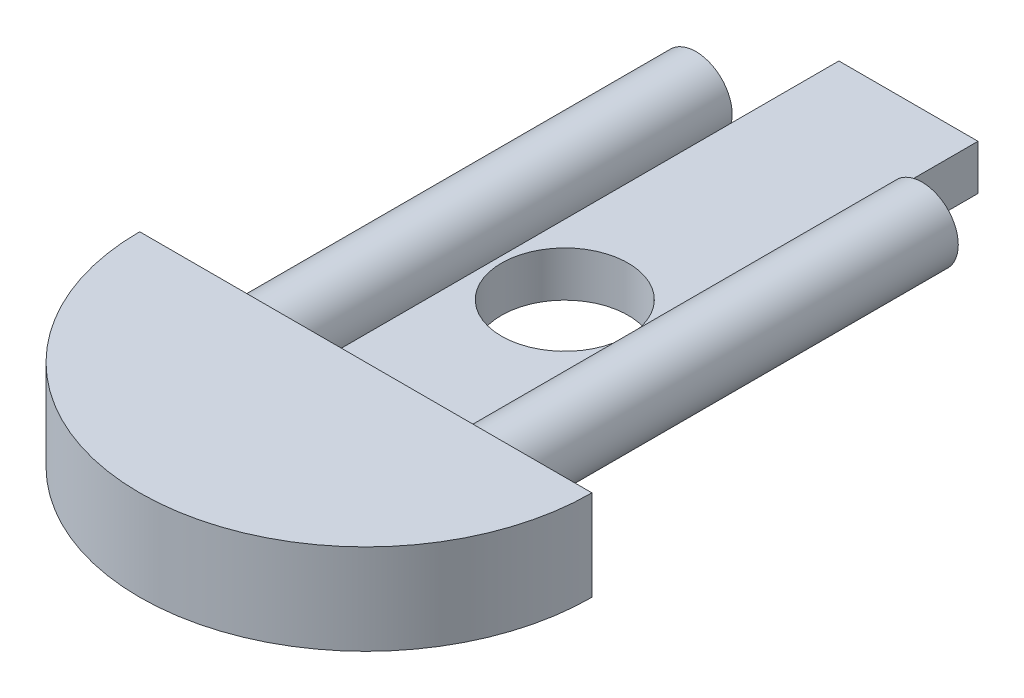
ISO-10303-21;
HEADER;
FILE_DESCRIPTION(('STEP AP214'),'2;1');
FILE_NAME('part.step','',(''),(''),'','','');
FILE_SCHEMA(('AUTOMOTIVE_DESIGN { 1 0 10303 214 1 1 1 1 }'));
ENDSEC;
DATA;
#1=APPLICATION_CONTEXT('core data for automotive mechanical design processes');
#2=APPLICATION_PROTOCOL_DEFINITION('international standard','automotive_design',2000,#1);
#3=PRODUCT_CONTEXT('',#1,'mechanical');
#4=PRODUCT('Part','Part','',(#3));
#5=PRODUCT_RELATED_PRODUCT_CATEGORY('part','',(#4));
#6=PRODUCT_DEFINITION_FORMATION('','',#4);
#7=PRODUCT_DEFINITION_CONTEXT('part definition',#1,'design');
#8=PRODUCT_DEFINITION('design','',#6,#7);
#9=PRODUCT_DEFINITION_SHAPE('','',#8);
#10=(LENGTH_UNIT() NAMED_UNIT(*) SI_UNIT(.MILLI.,.METRE.));
#11=(NAMED_UNIT(*) PLANE_ANGLE_UNIT() SI_UNIT($,.RADIAN.));
#12=(NAMED_UNIT(*) SI_UNIT($,.STERADIAN.) SOLID_ANGLE_UNIT());
#13=UNCERTAINTY_MEASURE_WITH_UNIT(LENGTH_MEASURE(1.E-05),#10,'distance_accuracy_value','');
#14=(GEOMETRIC_REPRESENTATION_CONTEXT(3) GLOBAL_UNCERTAINTY_ASSIGNED_CONTEXT((#13)) GLOBAL_UNIT_ASSIGNED_CONTEXT((#10,
#11,#12)) REPRESENTATION_CONTEXT('',''));
#15=CARTESIAN_POINT('',(0.,0.,0.));
#16=DIRECTION('',(0.,0.,1.));
#17=DIRECTION('',(1.,0.,0.));
#18=AXIS2_PLACEMENT_3D('',#15,#16,#17);
#19=CARTESIAN_POINT('',(63.5,0.,-2.21709065016539E-13));
#20=DIRECTION('',(0.,0.,1.));
#21=DIRECTION('',(1.,0.,0.));
#22=AXIS2_PLACEMENT_3D('',#19,#20,#21);
#23=PLANE('',#22);
#24=CARTESIAN_POINT('',(47.625,6.35,-1.11022302462516E-13));
#25=DIRECTION('',(0.,0.,1.));
#26=DIRECTION('',(1.,0.,0.));
#27=AXIS2_PLACEMENT_3D('',#24,#25,#26);
#28=CIRCLE('',#27,5.08);
#29=CARTESIAN_POINT('',(52.705,6.35,-1.46495752865162E-13));
#30=VERTEX_POINT('',#29);
#31=EDGE_CURVE('E48',#30,#30,#28,.F.);
#32=ORIENTED_EDGE('',*,*,#31,.F.);
#33=EDGE_LOOP('',(#32));
#34=FACE_BOUND('',#33,.T.);
#35=CARTESIAN_POINT('',(15.875,6.35,1.11022302462516E-13));
#36=DIRECTION('',(0.,0.,1.));
#37=DIRECTION('',(1.,0.,0.));
#38=AXIS2_PLACEMENT_3D('',#35,#36,#37);
#39=CIRCLE('',#38,5.08);
#40=CARTESIAN_POINT('',(20.955,6.35,0.));
#41=VERTEX_POINT('',#40);
#42=EDGE_CURVE('E11',#41,#41,#39,.F.);
#43=ORIENTED_EDGE('',*,*,#42,.F.);
#44=EDGE_LOOP('',(#43));
#45=FACE_BOUND('',#44,.T.);
#46=DIRECTION('',(0.,-1.,0.));
#47=VECTOR('',#46,1.);
#48=CARTESIAN_POINT('',(41.5036,0.,-2.8981808978962E-13));
#49=LINE('',#48,#47);
#50=CARTESIAN_POINT('',(41.5036,6.35,0.));
#51=VERTEX_POINT('',#50);
#52=CARTESIAN_POINT('',(41.5036,0.,0.));
#53=VERTEX_POINT('',#52);
#54=EDGE_CURVE('E55',#51,#53,#49,.T.);
#55=ORIENTED_EDGE('',*,*,#54,.F.);
#56=DIRECTION('',(1.,0.,0.));
#57=VECTOR('',#56,1.);
#58=CARTESIAN_POINT('',(41.5036,6.35,-2.8981808978962E-13));
#59=LINE('',#58,#57);
#60=CARTESIAN_POINT('',(21.971,6.35,-1.53422672991445E-13));
#61=VERTEX_POINT('',#60);
#62=EDGE_CURVE('E115',#61,#51,#59,.T.);
#63=ORIENTED_EDGE('',*,*,#62,.F.);
#64=DIRECTION('',(0.,1.,0.));
#65=VECTOR('',#64,1.);
#66=CARTESIAN_POINT('',(21.971,0.,-1.53422672991445E-13));
#67=LINE('',#66,#65);
#68=CARTESIAN_POINT('',(21.971,0.,0.));
#69=VERTEX_POINT('',#68);
#70=EDGE_CURVE('E61',#69,#61,#67,.T.);
#71=ORIENTED_EDGE('',*,*,#70,.F.);
#72=DIRECTION('',(-1.,0.,0.));
#73=VECTOR('',#72,1.);
#74=CARTESIAN_POINT('',(63.5,0.,-2.21709065016539E-13));
#75=LINE('',#74,#73);
#76=CARTESIAN_POINT('',(0.,0.,0.));
#77=VERTEX_POINT('',#76);
#78=EDGE_CURVE('E139',#69,#77,#75,.T.);
#79=ORIENTED_EDGE('',*,*,#78,.T.);
#80=DIRECTION('',(0.,-1.,0.));
#81=VECTOR('',#80,1.);
#82=CARTESIAN_POINT('',(0.,0.,0.));
#83=LINE('',#82,#81);
#84=CARTESIAN_POINT('',(0.,12.7,0.));
#85=VERTEX_POINT('',#84);
#86=EDGE_CURVE('E131',#85,#77,#83,.T.);
#87=ORIENTED_EDGE('',*,*,#86,.F.);
#88=DIRECTION('',(1.,0.,0.));
#89=VECTOR('',#88,1.);
#90=CARTESIAN_POINT('',(63.5,12.7,-2.21709065016539E-13));
#91=LINE('',#90,#89);
#92=CARTESIAN_POINT('',(63.5,12.7,-2.21709065016539E-13));
#93=VERTEX_POINT('',#92);
#94=EDGE_CURVE('E143',#85,#93,#91,.T.);
#95=ORIENTED_EDGE('',*,*,#94,.T.);
#96=DIRECTION('',(0.,-1.,0.));
#97=VECTOR('',#96,1.);
#98=CARTESIAN_POINT('',(63.5,0.,-2.21709065016539E-13));
#99=LINE('',#98,#97);
#100=CARTESIAN_POINT('',(63.5,0.,-2.21709065016539E-13));
#101=VERTEX_POINT('',#100);
#102=EDGE_CURVE('E135',#93,#101,#99,.T.);
#103=ORIENTED_EDGE('',*,*,#102,.T.);
#104=EDGE_CURVE('E140',#101,#53,#75,.T.);
#105=ORIENTED_EDGE('',*,*,#104,.T.);
#106=EDGE_LOOP('',(#55,#63,#71,#79,#87,#95,#103,#105));
#107=FACE_BOUND('',#106,.T.);
#108=ADVANCED_FACE('F39',(#34,#45,#107),#23,.F.);
#109=CARTESIAN_POINT('',(31.75,0.,0.));
#110=DIRECTION('',(0.,-1.,0.));
#111=DIRECTION('',(0.,0.,-1.));
#112=AXIS2_PLACEMENT_3D('',#109,#110,#111);
#113=CYLINDRICAL_SURFACE('',#112,31.75);
#114=CARTESIAN_POINT('',(31.75,12.7,0.));
#115=DIRECTION('',(0.,-1.,0.));
#116=DIRECTION('',(0.,0.,-1.));
#117=AXIS2_PLACEMENT_3D('',#114,#115,#116);
#118=CIRCLE('',#117,31.75);
#119=EDGE_CURVE('E151',#93,#85,#118,.T.);
#120=ORIENTED_EDGE('',*,*,#119,.T.);
#121=ORIENTED_EDGE('',*,*,#86,.T.);
#122=CARTESIAN_POINT('',(31.75,0.,0.));
#123=DIRECTION('',(0.,-1.,0.));
#124=DIRECTION('',(0.,0.,-1.));
#125=AXIS2_PLACEMENT_3D('',#122,#123,#124);
#126=CIRCLE('',#125,31.75);
#127=EDGE_CURVE('E147',#101,#77,#126,.T.);
#128=ORIENTED_EDGE('',*,*,#127,.F.);
#129=ORIENTED_EDGE('',*,*,#102,.F.);
#130=EDGE_LOOP('',(#120,#121,#128,#129));
#131=FACE_BOUND('',#130,.T.);
#132=ADVANCED_FACE('F162',(#131),#113,.T.);
#133=CARTESIAN_POINT('',(63.5,12.7,-2.21709065016539E-13));
#134=DIRECTION('',(0.,-1.,0.));
#135=DIRECTION('',(0.,0.,-1.));
#136=AXIS2_PLACEMENT_3D('',#133,#134,#135);
#137=PLANE('',#136);
#138=ORIENTED_EDGE('',*,*,#94,.F.);
#139=ORIENTED_EDGE('',*,*,#119,.F.);
#140=EDGE_LOOP('',(#138,#139));
#141=FACE_BOUND('',#140,.T.);
#142=ADVANCED_FACE('F41',(#141),#137,.F.);
#143=CARTESIAN_POINT('',(63.5,0.,-2.21709065016539E-13));
#144=DIRECTION('',(0.,1.,0.));
#145=DIRECTION('',(0.,0.,1.));
#146=AXIS2_PLACEMENT_3D('',#143,#144,#145);
#147=PLANE('',#146);
#148=CARTESIAN_POINT('',(31.75,0.,-27.94));
#149=DIRECTION('',(0.,1.,0.));
#150=DIRECTION('',(0.,0.,1.));
#151=AXIS2_PLACEMENT_3D('',#148,#149,#150);
#152=CIRCLE('',#151,8.88999999999999);
#153=CARTESIAN_POINT('',(31.75,0.,-19.05));
#154=VERTEX_POINT('',#153);
#155=EDGE_CURVE('E198',#154,#154,#152,.T.);
#156=ORIENTED_EDGE('',*,*,#155,.T.);
#157=EDGE_LOOP('',(#156));
#158=FACE_BOUND('',#157,.T.);
#159=ORIENTED_EDGE('',*,*,#104,.F.);
#160=ORIENTED_EDGE('',*,*,#127,.T.);
#161=ORIENTED_EDGE('',*,*,#78,.F.);
#162=DIRECTION('',(0.,0.,1.));
#163=VECTOR('',#162,1.);
#164=CARTESIAN_POINT('',(21.9709999999995,0.,-76.2000000000002));
#165=LINE('',#164,#163);
#166=CARTESIAN_POINT('',(21.9709999999995,0.,-76.2000000000002));
#167=VERTEX_POINT('',#166);
#168=EDGE_CURVE('E124',#167,#69,#165,.T.);
#169=ORIENTED_EDGE('',*,*,#168,.F.);
#170=DIRECTION('',(-1.,0.,0.));
#171=VECTOR('',#170,1.);
#172=CARTESIAN_POINT('',(41.5035999999995,0.,-76.2000000000003));
#173=LINE('',#172,#171);
#174=CARTESIAN_POINT('',(41.5035999999995,0.,-76.2000000000003));
#175=VERTEX_POINT('',#174);
#176=EDGE_CURVE('E102',#175,#167,#173,.T.);
#177=ORIENTED_EDGE('',*,*,#176,.F.);
#178=DIRECTION('',(0.,0.,1.));
#179=VECTOR('',#178,1.);
#180=CARTESIAN_POINT('',(41.5035999999995,0.,-76.2000000000003));
#181=LINE('',#180,#179);
#182=EDGE_CURVE('E98',#175,#53,#181,.T.);
#183=ORIENTED_EDGE('',*,*,#182,.T.);
#184=EDGE_LOOP('',(#159,#160,#161,#169,#177,#183));
#185=FACE_BOUND('',#184,.T.);
#186=ADVANCED_FACE('F184',(#158,#185),#147,.F.);
#187=CARTESIAN_POINT('',(47.6249999999996,6.35,-62.2300000000003));
#188=DIRECTION('',(0.,0.,1.));
#189=DIRECTION('',(1.,0.,0.));
#190=AXIS2_PLACEMENT_3D('',#187,#188,#189);
#191=CYLINDRICAL_SURFACE('',#190,5.08);
#192=CARTESIAN_POINT('',(47.6249999999996,6.35,-62.2300000000003));
#193=DIRECTION('',(0.,0.,-1.));
#194=DIRECTION('',(-1.,0.,0.));
#195=AXIS2_PLACEMENT_3D('',#192,#193,#194);
#196=CIRCLE('',#195,5.08);
#197=CARTESIAN_POINT('',(42.5449999999996,6.35,-62.2300000000003));
#198=VERTEX_POINT('',#197);
#199=EDGE_CURVE('E122',#198,#198,#196,.T.);
#200=ORIENTED_EDGE('',*,*,#199,.F.);
#201=EDGE_LOOP('',(#200));
#202=FACE_BOUND('',#201,.T.);
#203=ORIENTED_EDGE('',*,*,#31,.T.);
#204=EDGE_LOOP('',(#203));
#205=FACE_BOUND('',#204,.T.);
#206=ADVANCED_FACE('F158',(#202,#205),#191,.T.);
#207=CARTESIAN_POINT('',(47.6249999999996,6.35,-62.2300000000003));
#208=DIRECTION('',(0.,0.,-1.));
#209=DIRECTION('',(-1.,0.,0.));
#210=AXIS2_PLACEMENT_3D('',#207,#208,#209);
#211=PLANE('',#210);
#212=ORIENTED_EDGE('',*,*,#199,.T.);
#213=EDGE_LOOP('',(#212));
#214=FACE_BOUND('',#213,.T.);
#215=ADVANCED_FACE('F169',(#214),#211,.T.);
#216=CARTESIAN_POINT('',(15.8749999999996,6.35,-62.2300000000001));
#217=DIRECTION('',(0.,0.,1.));
#218=DIRECTION('',(1.,0.,0.));
#219=AXIS2_PLACEMENT_3D('',#216,#217,#218);
#220=CYLINDRICAL_SURFACE('',#219,5.08);
#221=CARTESIAN_POINT('',(15.8749999999996,6.35,-62.2300000000001));
#222=DIRECTION('',(0.,0.,-1.));
#223=DIRECTION('',(-1.,0.,0.));
#224=AXIS2_PLACEMENT_3D('',#221,#222,#223);
#225=CIRCLE('',#224,5.08);
#226=CARTESIAN_POINT('',(10.7949999999996,6.35,-62.2300000000001));
#227=VERTEX_POINT('',#226);
#228=EDGE_CURVE('E117',#227,#227,#225,.T.);
#229=ORIENTED_EDGE('',*,*,#228,.F.);
#230=EDGE_LOOP('',(#229));
#231=FACE_BOUND('',#230,.T.);
#232=ORIENTED_EDGE('',*,*,#42,.T.);
#233=EDGE_LOOP('',(#232));
#234=FACE_BOUND('',#233,.T.);
#235=ADVANCED_FACE('F166',(#231,#234),#220,.T.);
#236=CARTESIAN_POINT('',(15.8749999999996,6.35,-62.2300000000001));
#237=DIRECTION('',(0.,0.,-1.));
#238=DIRECTION('',(-1.,0.,0.));
#239=AXIS2_PLACEMENT_3D('',#236,#237,#238);
#240=PLANE('',#239);
#241=ORIENTED_EDGE('',*,*,#228,.T.);
#242=EDGE_LOOP('',(#241));
#243=FACE_BOUND('',#242,.T.);
#244=ADVANCED_FACE('F168',(#243),#240,.T.);
#245=CARTESIAN_POINT('',(41.5035999999995,6.35,-76.2000000000003));
#246=DIRECTION('',(0.,-1.,0.));
#247=DIRECTION('',(0.,0.,-1.));
#248=AXIS2_PLACEMENT_3D('',#245,#246,#247);
#249=PLANE('',#248);
#250=CARTESIAN_POINT('',(31.75,6.35,-27.94));
#251=DIRECTION('',(0.,1.,0.));
#252=DIRECTION('',(0.,0.,1.));
#253=AXIS2_PLACEMENT_3D('',#250,#251,#252);
#254=CIRCLE('',#253,8.88999999999999);
#255=CARTESIAN_POINT('',(31.75,6.35,-19.05));
#256=VERTEX_POINT('',#255);
#257=EDGE_CURVE('E224',#256,#256,#254,.T.);
#258=ORIENTED_EDGE('',*,*,#257,.F.);
#259=EDGE_LOOP('',(#258));
#260=FACE_BOUND('',#259,.T.);
#261=ORIENTED_EDGE('',*,*,#62,.T.);
#262=DIRECTION('',(0.,0.,1.));
#263=VECTOR('',#262,1.);
#264=CARTESIAN_POINT('',(41.5035999999995,6.35,-76.2000000000003));
#265=LINE('',#264,#263);
#266=CARTESIAN_POINT('',(41.5035999999995,6.35,-76.2000000000003));
#267=VERTEX_POINT('',#266);
#268=EDGE_CURVE('E95',#267,#51,#265,.T.);
#269=ORIENTED_EDGE('',*,*,#268,.F.);
#270=DIRECTION('',(1.,0.,0.));
#271=VECTOR('',#270,1.);
#272=CARTESIAN_POINT('',(41.5035999999995,6.35,-76.2000000000003));
#273=LINE('',#272,#271);
#274=CARTESIAN_POINT('',(21.9709999999995,6.35,-76.2000000000002));
#275=VERTEX_POINT('',#274);
#276=EDGE_CURVE('E103',#275,#267,#273,.T.);
#277=ORIENTED_EDGE('',*,*,#276,.F.);
#278=DIRECTION('',(0.,0.,1.));
#279=VECTOR('',#278,1.);
#280=CARTESIAN_POINT('',(21.9709999999995,6.35,-76.2000000000002));
#281=LINE('',#280,#279);
#282=EDGE_CURVE('E208',#275,#61,#281,.T.);
#283=ORIENTED_EDGE('',*,*,#282,.T.);
#284=EDGE_LOOP('',(#261,#269,#277,#283));
#285=FACE_BOUND('',#284,.T.);
#286=ADVANCED_FACE('F114',(#260,#285),#249,.F.);
#287=CARTESIAN_POINT('',(41.5035999999995,0.,-76.2000000000003));
#288=DIRECTION('',(-1.,0.,0.));
#289=DIRECTION('',(0.,0.,1.));
#290=AXIS2_PLACEMENT_3D('',#287,#288,#289);
#291=PLANE('',#290);
#292=ORIENTED_EDGE('',*,*,#54,.T.);
#293=ORIENTED_EDGE('',*,*,#182,.F.);
#294=DIRECTION('',(0.,-1.,0.));
#295=VECTOR('',#294,1.);
#296=CARTESIAN_POINT('',(41.5035999999995,0.,-76.2000000000003));
#297=LINE('',#296,#295);
#298=EDGE_CURVE('E91',#267,#175,#297,.T.);
#299=ORIENTED_EDGE('',*,*,#298,.F.);
#300=ORIENTED_EDGE('',*,*,#268,.T.);
#301=EDGE_LOOP('',(#292,#293,#299,#300));
#302=FACE_BOUND('',#301,.T.);
#303=ADVANCED_FACE('F93',(#302),#291,.F.);
#304=CARTESIAN_POINT('',(21.9709999999995,0.,-76.2000000000002));
#305=DIRECTION('',(1.,0.,0.));
#306=DIRECTION('',(0.,0.,-1.));
#307=AXIS2_PLACEMENT_3D('',#304,#305,#306);
#308=PLANE('',#307);
#309=ORIENTED_EDGE('',*,*,#70,.T.);
#310=ORIENTED_EDGE('',*,*,#282,.F.);
#311=DIRECTION('',(0.,1.,0.));
#312=VECTOR('',#311,1.);
#313=CARTESIAN_POINT('',(21.9709999999995,0.,-76.2000000000002));
#314=LINE('',#313,#312);
#315=EDGE_CURVE('E108',#167,#275,#314,.T.);
#316=ORIENTED_EDGE('',*,*,#315,.F.);
#317=ORIENTED_EDGE('',*,*,#168,.T.);
#318=EDGE_LOOP('',(#309,#310,#316,#317));
#319=FACE_BOUND('',#318,.T.);
#320=ADVANCED_FACE('F206',(#319),#308,.F.);
#321=CARTESIAN_POINT('',(-5.32101756039693E-13,0.,-76.2));
#322=DIRECTION('',(0.,0.,-1.));
#323=DIRECTION('',(-1.,0.,0.));
#324=AXIS2_PLACEMENT_3D('',#321,#322,#323);
#325=PLANE('',#324);
#326=ORIENTED_EDGE('',*,*,#276,.T.);
#327=ORIENTED_EDGE('',*,*,#298,.T.);
#328=ORIENTED_EDGE('',*,*,#176,.T.);
#329=ORIENTED_EDGE('',*,*,#315,.T.);
#330=EDGE_LOOP('',(#326,#327,#328,#329));
#331=FACE_BOUND('',#330,.T.);
#332=ADVANCED_FACE('F106',(#331),#325,.T.);
#333=CARTESIAN_POINT('',(31.75,-69.85,-27.94));
#334=DIRECTION('',(0.,1.,0.));
#335=DIRECTION('',(0.,0.,1.));
#336=AXIS2_PLACEMENT_3D('',#333,#334,#335);
#337=CYLINDRICAL_SURFACE('',#336,8.88999999999999);
#338=ORIENTED_EDGE('',*,*,#257,.T.);
#339=EDGE_LOOP('',(#338));
#340=FACE_BOUND('',#339,.T.);
#341=ORIENTED_EDGE('',*,*,#155,.F.);
#342=EDGE_LOOP('',(#341));
#343=FACE_BOUND('',#342,.T.);
#344=ADVANCED_FACE('F229',(#340,#343),#337,.F.);
#345=CLOSED_SHELL('',(#108,#132,#142,#186,#206,#215,#235,#244,#286,#303,#320,#332,#344));
#346=MANIFOLD_SOLID_BREP('B2',#345);
#347=ADVANCED_BREP_SHAPE_REPRESENTATION('',(#18,#346),#14);
#348=SHAPE_DEFINITION_REPRESENTATION(#9,#347);
ENDSEC;
END-ISO-10303-21;
